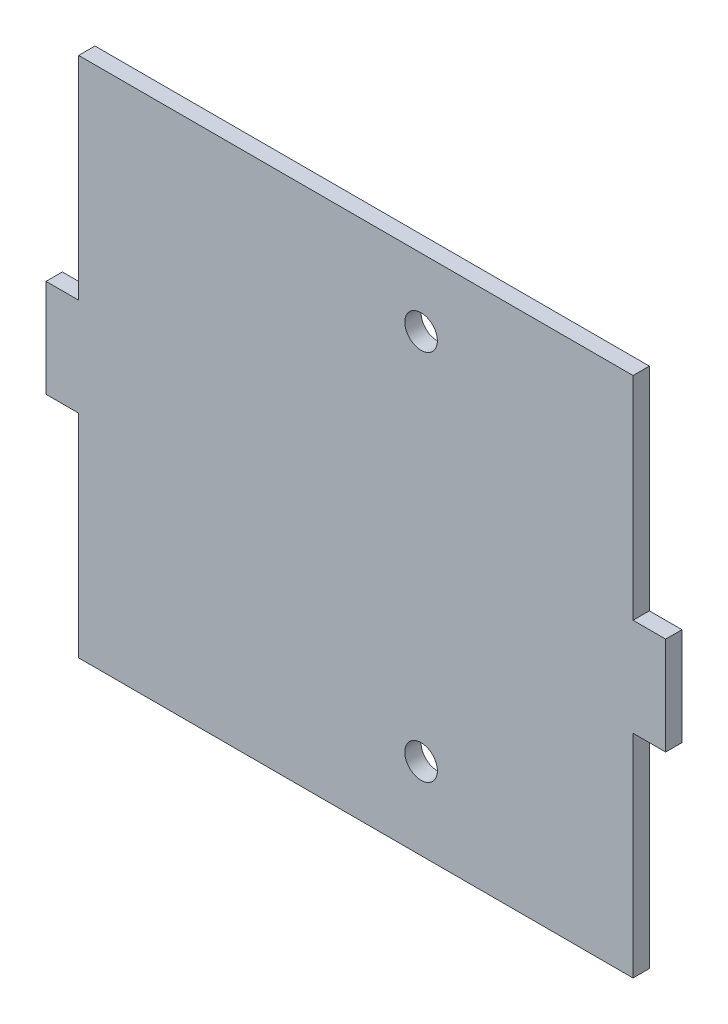
ISO-10303-21;
HEADER;
FILE_DESCRIPTION(('STEP AP214'),'2;1');
FILE_NAME('part.step','',(''),(''),'','','');
FILE_SCHEMA(('AUTOMOTIVE_DESIGN { 1 0 10303 214 1 1 1 1 }'));
ENDSEC;
DATA;
#1=APPLICATION_CONTEXT('core data for automotive mechanical design processes');
#2=APPLICATION_PROTOCOL_DEFINITION('international standard','automotive_design',2000,#1);
#3=PRODUCT_CONTEXT('',#1,'mechanical');
#4=PRODUCT('Part','Part','',(#3));
#5=PRODUCT_RELATED_PRODUCT_CATEGORY('part','',(#4));
#6=PRODUCT_DEFINITION_FORMATION('','',#4);
#7=PRODUCT_DEFINITION_CONTEXT('part definition',#1,'design');
#8=PRODUCT_DEFINITION('design','',#6,#7);
#9=PRODUCT_DEFINITION_SHAPE('','',#8);
#10=(LENGTH_UNIT() NAMED_UNIT(*) SI_UNIT(.MILLI.,.METRE.));
#11=(NAMED_UNIT(*) PLANE_ANGLE_UNIT() SI_UNIT($,.RADIAN.));
#12=(NAMED_UNIT(*) SI_UNIT($,.STERADIAN.) SOLID_ANGLE_UNIT());
#13=UNCERTAINTY_MEASURE_WITH_UNIT(LENGTH_MEASURE(1.E-05),#10,'distance_accuracy_value','');
#14=(GEOMETRIC_REPRESENTATION_CONTEXT(3) GLOBAL_UNCERTAINTY_ASSIGNED_CONTEXT((#13)) GLOBAL_UNIT_ASSIGNED_CONTEXT((#10,
#11,#12)) REPRESENTATION_CONTEXT('',''));
#15=CARTESIAN_POINT('',(0.,0.,0.));
#16=DIRECTION('',(0.,0.,1.));
#17=DIRECTION('',(1.,0.,0.));
#18=AXIS2_PLACEMENT_3D('',#15,#16,#17);
#19=CARTESIAN_POINT('',(215.9,-38.1,6.35));
#20=DIRECTION('',(-1.,0.,0.));
#21=DIRECTION('',(0.,-1.,0.));
#22=AXIS2_PLACEMENT_3D('',#19,#20,#21);
#23=PLANE('',#22);
#24=DIRECTION('',(0.,1.,0.));
#25=VECTOR('',#24,1.);
#26=CARTESIAN_POINT('',(215.9,-38.1,-6.35));
#27=LINE('',#26,#25);
#28=CARTESIAN_POINT('',(215.9,-203.2,-6.35));
#29=VERTEX_POINT('',#28);
#30=CARTESIAN_POINT('',(215.9,-38.1,-6.35));
#31=VERTEX_POINT('',#30);
#32=EDGE_CURVE('E182',#29,#31,#27,.T.);
#33=ORIENTED_EDGE('',*,*,#32,.T.);
#34=DIRECTION('',(0.,0.,-1.));
#35=VECTOR('',#34,1.);
#36=CARTESIAN_POINT('',(215.9,-38.1,6.35));
#37=LINE('',#36,#35);
#38=CARTESIAN_POINT('',(215.9,-38.1,6.35));
#39=VERTEX_POINT('',#38);
#40=EDGE_CURVE('E162',#39,#31,#37,.T.);
#41=ORIENTED_EDGE('',*,*,#40,.F.);
#42=DIRECTION('',(0.,1.,0.));
#43=VECTOR('',#42,1.);
#44=CARTESIAN_POINT('',(215.9,-38.1,6.35));
#45=LINE('',#44,#43);
#46=CARTESIAN_POINT('',(215.9,-203.2,6.35));
#47=VERTEX_POINT('',#46);
#48=EDGE_CURVE('E216',#47,#39,#45,.T.);
#49=ORIENTED_EDGE('',*,*,#48,.F.);
#50=DIRECTION('',(0.,0.,-1.));
#51=VECTOR('',#50,1.);
#52=CARTESIAN_POINT('',(215.9,-203.2,6.35));
#53=LINE('',#52,#51);
#54=EDGE_CURVE('E165',#47,#29,#53,.T.);
#55=ORIENTED_EDGE('',*,*,#54,.T.);
#56=EDGE_LOOP('',(#33,#41,#49,#55));
#57=FACE_BOUND('',#56,.T.);
#58=ADVANCED_FACE('F46',(#57),#23,.F.);
#59=CARTESIAN_POINT('',(215.9,-38.1,6.35));
#60=DIRECTION('',(0.,1.,0.));
#61=DIRECTION('',(-1.,0.,0.));
#62=AXIS2_PLACEMENT_3D('',#59,#60,#61);
#63=PLANE('',#62);
#64=DIRECTION('',(1.,0.,0.));
#65=VECTOR('',#64,1.);
#66=CARTESIAN_POINT('',(215.9,-38.1,-6.35));
#67=LINE('',#66,#65);
#68=CARTESIAN_POINT('',(241.3,-38.1,-6.35));
#69=VERTEX_POINT('',#68);
#70=EDGE_CURVE('E66',#31,#69,#67,.T.);
#71=ORIENTED_EDGE('',*,*,#70,.T.);
#72=DIRECTION('',(0.,0.,-1.));
#73=VECTOR('',#72,1.);
#74=CARTESIAN_POINT('',(241.3,-38.1,6.35));
#75=LINE('',#74,#73);
#76=CARTESIAN_POINT('',(241.3,-38.1,6.35));
#77=VERTEX_POINT('',#76);
#78=EDGE_CURVE('E159',#77,#69,#75,.T.);
#79=ORIENTED_EDGE('',*,*,#78,.F.);
#80=DIRECTION('',(1.,0.,0.));
#81=VECTOR('',#80,1.);
#82=CARTESIAN_POINT('',(215.9,-38.1,6.35));
#83=LINE('',#82,#81);
#84=EDGE_CURVE('E111',#39,#77,#83,.T.);
#85=ORIENTED_EDGE('',*,*,#84,.F.);
#86=ORIENTED_EDGE('',*,*,#40,.T.);
#87=EDGE_LOOP('',(#71,#79,#85,#86));
#88=FACE_BOUND('',#87,.T.);
#89=ADVANCED_FACE('F158',(#88),#63,.F.);
#90=CARTESIAN_POINT('',(241.3,38.1,6.35));
#91=DIRECTION('',(-1.,0.,0.));
#92=DIRECTION('',(0.,0.,1.));
#93=AXIS2_PLACEMENT_3D('',#90,#91,#92);
#94=PLANE('',#93);
#95=DIRECTION('',(0.,1.,0.));
#96=VECTOR('',#95,1.);
#97=CARTESIAN_POINT('',(241.3,38.1,-6.35));
#98=LINE('',#97,#96);
#99=CARTESIAN_POINT('',(241.3,38.1,-6.35));
#100=VERTEX_POINT('',#99);
#101=EDGE_CURVE('E155',#69,#100,#98,.T.);
#102=ORIENTED_EDGE('',*,*,#101,.T.);
#103=DIRECTION('',(0.,0.,-1.));
#104=VECTOR('',#103,1.);
#105=CARTESIAN_POINT('',(241.3,38.1,6.35));
#106=LINE('',#105,#104);
#107=CARTESIAN_POINT('',(241.3,38.1,6.35));
#108=VERTEX_POINT('',#107);
#109=EDGE_CURVE('E264',#108,#100,#106,.T.);
#110=ORIENTED_EDGE('',*,*,#109,.F.);
#111=DIRECTION('',(0.,1.,0.));
#112=VECTOR('',#111,1.);
#113=CARTESIAN_POINT('',(241.3,38.1,6.35));
#114=LINE('',#113,#112);
#115=EDGE_CURVE('E168',#77,#108,#114,.T.);
#116=ORIENTED_EDGE('',*,*,#115,.F.);
#117=ORIENTED_EDGE('',*,*,#78,.T.);
#118=EDGE_LOOP('',(#102,#110,#116,#117));
#119=FACE_BOUND('',#118,.T.);
#120=ADVANCED_FACE('F167',(#119),#94,.F.);
#121=CARTESIAN_POINT('',(215.9,38.1,6.35));
#122=DIRECTION('',(0.,-1.,0.));
#123=DIRECTION('',(0.,0.,-1.));
#124=AXIS2_PLACEMENT_3D('',#121,#122,#123);
#125=PLANE('',#124);
#126=DIRECTION('',(-1.,0.,0.));
#127=VECTOR('',#126,1.);
#128=CARTESIAN_POINT('',(215.9,38.1,-6.35));
#129=LINE('',#128,#127);
#130=CARTESIAN_POINT('',(215.9,38.1,-6.35));
#131=VERTEX_POINT('',#130);
#132=EDGE_CURVE('E170',#100,#131,#129,.T.);
#133=ORIENTED_EDGE('',*,*,#132,.T.);
#134=DIRECTION('',(0.,0.,-1.));
#135=VECTOR('',#134,1.);
#136=CARTESIAN_POINT('',(215.9,38.1,6.35));
#137=LINE('',#136,#135);
#138=CARTESIAN_POINT('',(215.9,38.1,6.35));
#139=VERTEX_POINT('',#138);
#140=EDGE_CURVE('E261',#139,#131,#137,.T.);
#141=ORIENTED_EDGE('',*,*,#140,.F.);
#142=DIRECTION('',(-1.,0.,0.));
#143=VECTOR('',#142,1.);
#144=CARTESIAN_POINT('',(215.9,38.1,6.35));
#145=LINE('',#144,#143);
#146=EDGE_CURVE('E209',#108,#139,#145,.T.);
#147=ORIENTED_EDGE('',*,*,#146,.F.);
#148=ORIENTED_EDGE('',*,*,#109,.T.);
#149=EDGE_LOOP('',(#133,#141,#147,#148));
#150=FACE_BOUND('',#149,.T.);
#151=ADVANCED_FACE('F333',(#150),#125,.F.);
#152=CARTESIAN_POINT('',(215.9,203.2,6.35));
#153=DIRECTION('',(-1.,0.,0.));
#154=DIRECTION('',(0.,-1.,0.));
#155=AXIS2_PLACEMENT_3D('',#152,#153,#154);
#156=PLANE('',#155);
#157=DIRECTION('',(0.,1.,0.));
#158=VECTOR('',#157,1.);
#159=CARTESIAN_POINT('',(215.9,203.2,-6.35));
#160=LINE('',#159,#158);
#161=CARTESIAN_POINT('',(215.9,203.2,-6.35));
#162=VERTEX_POINT('',#161);
#163=EDGE_CURVE('E262',#131,#162,#160,.T.);
#164=ORIENTED_EDGE('',*,*,#163,.T.);
#165=DIRECTION('',(0.,0.,-1.));
#166=VECTOR('',#165,1.);
#167=CARTESIAN_POINT('',(215.9,203.2,6.35));
#168=LINE('',#167,#166);
#169=CARTESIAN_POINT('',(215.9,203.2,6.35));
#170=VERTEX_POINT('',#169);
#171=EDGE_CURVE('E258',#170,#162,#168,.T.);
#172=ORIENTED_EDGE('',*,*,#171,.F.);
#173=DIRECTION('',(0.,1.,0.));
#174=VECTOR('',#173,1.);
#175=CARTESIAN_POINT('',(215.9,203.2,6.35));
#176=LINE('',#175,#174);
#177=EDGE_CURVE('E206',#139,#170,#176,.T.);
#178=ORIENTED_EDGE('',*,*,#177,.F.);
#179=ORIENTED_EDGE('',*,*,#140,.T.);
#180=EDGE_LOOP('',(#164,#172,#178,#179));
#181=FACE_BOUND('',#180,.T.);
#182=ADVANCED_FACE('F336',(#181),#156,.F.);
#183=CARTESIAN_POINT('',(-215.9,203.2,6.35));
#184=DIRECTION('',(0.,-1.,0.));
#185=DIRECTION('',(0.,0.,-1.));
#186=AXIS2_PLACEMENT_3D('',#183,#184,#185);
#187=PLANE('',#186);
#188=DIRECTION('',(-1.,0.,0.));
#189=VECTOR('',#188,1.);
#190=CARTESIAN_POINT('',(-215.9,203.2,-6.35));
#191=LINE('',#190,#189);
#192=CARTESIAN_POINT('',(-215.9,203.2,-6.35));
#193=VERTEX_POINT('',#192);
#194=EDGE_CURVE('E259',#162,#193,#191,.T.);
#195=ORIENTED_EDGE('',*,*,#194,.T.);
#196=DIRECTION('',(0.,0.,-1.));
#197=VECTOR('',#196,1.);
#198=CARTESIAN_POINT('',(-215.9,203.2,6.35));
#199=LINE('',#198,#197);
#200=CARTESIAN_POINT('',(-215.9,203.2,6.35));
#201=VERTEX_POINT('',#200);
#202=EDGE_CURVE('E254',#201,#193,#199,.T.);
#203=ORIENTED_EDGE('',*,*,#202,.F.);
#204=DIRECTION('',(-1.,0.,0.));
#205=VECTOR('',#204,1.);
#206=CARTESIAN_POINT('',(-215.9,203.2,6.35));
#207=LINE('',#206,#205);
#208=EDGE_CURVE('E203',#170,#201,#207,.T.);
#209=ORIENTED_EDGE('',*,*,#208,.F.);
#210=ORIENTED_EDGE('',*,*,#171,.T.);
#211=EDGE_LOOP('',(#195,#203,#209,#210));
#212=FACE_BOUND('',#211,.T.);
#213=ADVANCED_FACE('F339',(#212),#187,.F.);
#214=CARTESIAN_POINT('',(-215.9,203.2,6.35));
#215=DIRECTION('',(1.,0.,0.));
#216=DIRECTION('',(0.,0.,-1.));
#217=AXIS2_PLACEMENT_3D('',#214,#215,#216);
#218=PLANE('',#217);
#219=DIRECTION('',(0.,-1.,0.));
#220=VECTOR('',#219,1.);
#221=CARTESIAN_POINT('',(-215.9,203.2,-6.35));
#222=LINE('',#221,#220);
#223=CARTESIAN_POINT('',(-215.9,38.1,-6.35));
#224=VERTEX_POINT('',#223);
#225=EDGE_CURVE('E255',#193,#224,#222,.T.);
#226=ORIENTED_EDGE('',*,*,#225,.T.);
#227=DIRECTION('',(0.,0.,-1.));
#228=VECTOR('',#227,1.);
#229=CARTESIAN_POINT('',(-215.9,38.1,6.35));
#230=LINE('',#229,#228);
#231=CARTESIAN_POINT('',(-215.9,38.1,6.35));
#232=VERTEX_POINT('',#231);
#233=EDGE_CURVE('E250',#232,#224,#230,.T.);
#234=ORIENTED_EDGE('',*,*,#233,.F.);
#235=DIRECTION('',(0.,-1.,0.));
#236=VECTOR('',#235,1.);
#237=CARTESIAN_POINT('',(-215.9,203.2,6.35));
#238=LINE('',#237,#236);
#239=EDGE_CURVE('E200',#201,#232,#238,.T.);
#240=ORIENTED_EDGE('',*,*,#239,.F.);
#241=ORIENTED_EDGE('',*,*,#202,.T.);
#242=EDGE_LOOP('',(#226,#234,#240,#241));
#243=FACE_BOUND('',#242,.T.);
#244=ADVANCED_FACE('F342',(#243),#218,.F.);
#245=CARTESIAN_POINT('',(-215.9,38.1,6.35));
#246=DIRECTION('',(0.,-1.,0.));
#247=DIRECTION('',(1.,0.,0.));
#248=AXIS2_PLACEMENT_3D('',#245,#246,#247);
#249=PLANE('',#248);
#250=DIRECTION('',(-1.,0.,0.));
#251=VECTOR('',#250,1.);
#252=CARTESIAN_POINT('',(-215.9,38.1,-6.35));
#253=LINE('',#252,#251);
#254=CARTESIAN_POINT('',(-241.3,38.1,-6.35));
#255=VERTEX_POINT('',#254);
#256=EDGE_CURVE('E251',#224,#255,#253,.T.);
#257=ORIENTED_EDGE('',*,*,#256,.T.);
#258=DIRECTION('',(0.,0.,-1.));
#259=VECTOR('',#258,1.);
#260=CARTESIAN_POINT('',(-241.3,38.1,6.35));
#261=LINE('',#260,#259);
#262=CARTESIAN_POINT('',(-241.3,38.1,6.35));
#263=VERTEX_POINT('',#262);
#264=EDGE_CURVE('E246',#263,#255,#261,.T.);
#265=ORIENTED_EDGE('',*,*,#264,.F.);
#266=DIRECTION('',(-1.,0.,0.));
#267=VECTOR('',#266,1.);
#268=CARTESIAN_POINT('',(-215.9,38.1,6.35));
#269=LINE('',#268,#267);
#270=EDGE_CURVE('E197',#232,#263,#269,.T.);
#271=ORIENTED_EDGE('',*,*,#270,.F.);
#272=ORIENTED_EDGE('',*,*,#233,.T.);
#273=EDGE_LOOP('',(#257,#265,#271,#272));
#274=FACE_BOUND('',#273,.T.);
#275=ADVANCED_FACE('F346',(#274),#249,.F.);
#276=CARTESIAN_POINT('',(-241.3,38.1,6.35));
#277=DIRECTION('',(1.,0.,0.));
#278=DIRECTION('',(0.,0.,-1.));
#279=AXIS2_PLACEMENT_3D('',#276,#277,#278);
#280=PLANE('',#279);
#281=DIRECTION('',(0.,-1.,0.));
#282=VECTOR('',#281,1.);
#283=CARTESIAN_POINT('',(-241.3,38.1,-6.35));
#284=LINE('',#283,#282);
#285=CARTESIAN_POINT('',(-241.3,-38.1,-6.35));
#286=VERTEX_POINT('',#285);
#287=EDGE_CURVE('E247',#255,#286,#284,.T.);
#288=ORIENTED_EDGE('',*,*,#287,.T.);
#289=DIRECTION('',(0.,0.,-1.));
#290=VECTOR('',#289,1.);
#291=CARTESIAN_POINT('',(-241.3,-38.1,6.35));
#292=LINE('',#291,#290);
#293=CARTESIAN_POINT('',(-241.3,-38.1,6.35));
#294=VERTEX_POINT('',#293);
#295=EDGE_CURVE('E242',#294,#286,#292,.T.);
#296=ORIENTED_EDGE('',*,*,#295,.F.);
#297=DIRECTION('',(0.,-1.,0.));
#298=VECTOR('',#297,1.);
#299=CARTESIAN_POINT('',(-241.3,38.1,6.35));
#300=LINE('',#299,#298);
#301=EDGE_CURVE('E194',#263,#294,#300,.T.);
#302=ORIENTED_EDGE('',*,*,#301,.F.);
#303=ORIENTED_EDGE('',*,*,#264,.T.);
#304=EDGE_LOOP('',(#288,#296,#302,#303));
#305=FACE_BOUND('',#304,.T.);
#306=ADVANCED_FACE('F350',(#305),#280,.F.);
#307=CARTESIAN_POINT('',(-215.9,-38.1,6.35));
#308=DIRECTION('',(0.,1.,0.));
#309=DIRECTION('',(-1.,0.,0.));
#310=AXIS2_PLACEMENT_3D('',#307,#308,#309);
#311=PLANE('',#310);
#312=DIRECTION('',(1.,0.,0.));
#313=VECTOR('',#312,1.);
#314=CARTESIAN_POINT('',(-215.9,-38.1,-6.35));
#315=LINE('',#314,#313);
#316=CARTESIAN_POINT('',(-215.9,-38.1,-6.35));
#317=VERTEX_POINT('',#316);
#318=EDGE_CURVE('E243',#286,#317,#315,.T.);
#319=ORIENTED_EDGE('',*,*,#318,.T.);
#320=DIRECTION('',(0.,0.,-1.));
#321=VECTOR('',#320,1.);
#322=CARTESIAN_POINT('',(-215.9,-38.1,6.35));
#323=LINE('',#322,#321);
#324=CARTESIAN_POINT('',(-215.9,-38.1,6.35));
#325=VERTEX_POINT('',#324);
#326=EDGE_CURVE('E232',#325,#317,#323,.T.);
#327=ORIENTED_EDGE('',*,*,#326,.F.);
#328=DIRECTION('',(1.,0.,0.));
#329=VECTOR('',#328,1.);
#330=CARTESIAN_POINT('',(-215.9,-38.1,6.35));
#331=LINE('',#330,#329);
#332=EDGE_CURVE('E191',#294,#325,#331,.T.);
#333=ORIENTED_EDGE('',*,*,#332,.F.);
#334=ORIENTED_EDGE('',*,*,#295,.T.);
#335=EDGE_LOOP('',(#319,#327,#333,#334));
#336=FACE_BOUND('',#335,.T.);
#337=ADVANCED_FACE('F292',(#336),#311,.F.);
#338=CARTESIAN_POINT('',(-215.9,-38.1,6.35));
#339=DIRECTION('',(1.,0.,0.));
#340=DIRECTION('',(0.,1.,0.));
#341=AXIS2_PLACEMENT_3D('',#338,#339,#340);
#342=PLANE('',#341);
#343=DIRECTION('',(0.,-1.,0.));
#344=VECTOR('',#343,1.);
#345=CARTESIAN_POINT('',(-215.9,-38.1,-6.35));
#346=LINE('',#345,#344);
#347=CARTESIAN_POINT('',(-215.9,-203.2,-6.35));
#348=VERTEX_POINT('',#347);
#349=EDGE_CURVE('E239',#317,#348,#346,.T.);
#350=ORIENTED_EDGE('',*,*,#349,.T.);
#351=DIRECTION('',(0.,0.,-1.));
#352=VECTOR('',#351,1.);
#353=CARTESIAN_POINT('',(-215.9,-203.2,6.35));
#354=LINE('',#353,#352);
#355=CARTESIAN_POINT('',(-215.9,-203.2,6.35));
#356=VERTEX_POINT('',#355);
#357=EDGE_CURVE('E221',#356,#348,#354,.T.);
#358=ORIENTED_EDGE('',*,*,#357,.F.);
#359=DIRECTION('',(0.,-1.,0.));
#360=VECTOR('',#359,1.);
#361=CARTESIAN_POINT('',(-215.9,-38.1,6.35));
#362=LINE('',#361,#360);
#363=EDGE_CURVE('E188',#325,#356,#362,.T.);
#364=ORIENTED_EDGE('',*,*,#363,.F.);
#365=ORIENTED_EDGE('',*,*,#326,.T.);
#366=EDGE_LOOP('',(#350,#358,#364,#365));
#367=FACE_BOUND('',#366,.T.);
#368=ADVANCED_FACE('F301',(#367),#342,.F.);
#369=CARTESIAN_POINT('',(-215.9,-203.2,6.35));
#370=DIRECTION('',(0.,1.,0.));
#371=DIRECTION('',(0.,0.,1.));
#372=AXIS2_PLACEMENT_3D('',#369,#370,#371);
#373=PLANE('',#372);
#374=DIRECTION('',(1.,0.,0.));
#375=VECTOR('',#374,1.);
#376=CARTESIAN_POINT('',(-215.9,-203.2,-6.35));
#377=LINE('',#376,#375);
#378=EDGE_CURVE('E120',#348,#29,#377,.T.);
#379=ORIENTED_EDGE('',*,*,#378,.T.);
#380=ORIENTED_EDGE('',*,*,#54,.F.);
#381=DIRECTION('',(1.,0.,0.));
#382=VECTOR('',#381,1.);
#383=CARTESIAN_POINT('',(-215.9,-203.2,6.35));
#384=LINE('',#383,#382);
#385=EDGE_CURVE('E185',#356,#47,#384,.T.);
#386=ORIENTED_EDGE('',*,*,#385,.F.);
#387=ORIENTED_EDGE('',*,*,#357,.T.);
#388=EDGE_LOOP('',(#379,#380,#386,#387));
#389=FACE_BOUND('',#388,.T.);
#390=ADVANCED_FACE('F320',(#389),#373,.F.);
#391=CARTESIAN_POINT('',(0.,0.,6.35));
#392=DIRECTION('',(0.,0.,1.));
#393=DIRECTION('',(1.,0.,0.));
#394=AXIS2_PLACEMENT_3D('',#391,#392,#393);
#395=PLANE('',#394);
#396=CARTESIAN_POINT('',(50.8000000000004,150.299999999983,6.34999999999999));
#397=DIRECTION('',(0.,0.,1.));
#398=DIRECTION('',(1.,0.,0.));
#399=AXIS2_PLACEMENT_3D('',#396,#397,#398);
#400=CIRCLE('',#399,12.7000000000001);
#401=CARTESIAN_POINT('',(63.5000000000005,150.299999999983,6.34999999999999));
#402=VERTEX_POINT('',#401);
#403=EDGE_CURVE('E218',#402,#402,#400,.F.);
#404=ORIENTED_EDGE('',*,*,#403,.T.);
#405=EDGE_LOOP('',(#404));
#406=FACE_BOUND('',#405,.T.);
#407=CARTESIAN_POINT('',(50.8000000000004,-139.700000000005,6.34999999999999));
#408=DIRECTION('',(0.,0.,1.));
#409=DIRECTION('',(1.,0.,0.));
#410=AXIS2_PLACEMENT_3D('',#407,#408,#409);
#411=CIRCLE('',#410,12.7000000000001);
#412=CARTESIAN_POINT('',(63.5000000000005,-139.700000000005,6.34999999999999));
#413=VERTEX_POINT('',#412);
#414=EDGE_CURVE('E50',#413,#413,#411,.F.);
#415=ORIENTED_EDGE('',*,*,#414,.T.);
#416=EDGE_LOOP('',(#415));
#417=FACE_BOUND('',#416,.T.);
#418=ORIENTED_EDGE('',*,*,#48,.T.);
#419=ORIENTED_EDGE('',*,*,#84,.T.);
#420=ORIENTED_EDGE('',*,*,#115,.T.);
#421=ORIENTED_EDGE('',*,*,#146,.T.);
#422=ORIENTED_EDGE('',*,*,#177,.T.);
#423=ORIENTED_EDGE('',*,*,#208,.T.);
#424=ORIENTED_EDGE('',*,*,#239,.T.);
#425=ORIENTED_EDGE('',*,*,#270,.T.);
#426=ORIENTED_EDGE('',*,*,#301,.T.);
#427=ORIENTED_EDGE('',*,*,#332,.T.);
#428=ORIENTED_EDGE('',*,*,#363,.T.);
#429=ORIENTED_EDGE('',*,*,#385,.T.);
#430=EDGE_LOOP('',(#418,#419,#420,#421,#422,#423,#424,#425,#426,#427,#428,#429));
#431=FACE_BOUND('',#430,.T.);
#432=ADVANCED_FACE('F48',(#406,#417,#431),#395,.T.);
#433=CARTESIAN_POINT('',(0.,0.,-6.35));
#434=DIRECTION('',(0.,0.,1.));
#435=DIRECTION('',(1.,0.,0.));
#436=AXIS2_PLACEMENT_3D('',#433,#434,#435);
#437=PLANE('',#436);
#438=CARTESIAN_POINT('',(50.8000000000004,150.299999999983,-6.35000000000002));
#439=DIRECTION('',(0.,0.,1.));
#440=DIRECTION('',(1.,0.,0.));
#441=AXIS2_PLACEMENT_3D('',#438,#439,#440);
#442=CIRCLE('',#441,12.7000000000001);
#443=CARTESIAN_POINT('',(63.5000000000005,150.299999999983,-6.35000000000002));
#444=VERTEX_POINT('',#443);
#445=EDGE_CURVE('E11',#444,#444,#442,.F.);
#446=ORIENTED_EDGE('',*,*,#445,.F.);
#447=EDGE_LOOP('',(#446));
#448=FACE_BOUND('',#447,.T.);
#449=CARTESIAN_POINT('',(50.8000000000004,-139.700000000005,-6.34999999999999));
#450=DIRECTION('',(0.,0.,1.));
#451=DIRECTION('',(1.,0.,0.));
#452=AXIS2_PLACEMENT_3D('',#449,#450,#451);
#453=CIRCLE('',#452,12.7000000000001);
#454=CARTESIAN_POINT('',(63.5000000000005,-139.700000000005,-6.34999999999999));
#455=VERTEX_POINT('',#454);
#456=EDGE_CURVE('E57',#455,#455,#453,.F.);
#457=ORIENTED_EDGE('',*,*,#456,.F.);
#458=EDGE_LOOP('',(#457));
#459=FACE_BOUND('',#458,.T.);
#460=ORIENTED_EDGE('',*,*,#32,.F.);
#461=ORIENTED_EDGE('',*,*,#378,.F.);
#462=ORIENTED_EDGE('',*,*,#349,.F.);
#463=ORIENTED_EDGE('',*,*,#318,.F.);
#464=ORIENTED_EDGE('',*,*,#287,.F.);
#465=ORIENTED_EDGE('',*,*,#256,.F.);
#466=ORIENTED_EDGE('',*,*,#225,.F.);
#467=ORIENTED_EDGE('',*,*,#194,.F.);
#468=ORIENTED_EDGE('',*,*,#163,.F.);
#469=ORIENTED_EDGE('',*,*,#132,.F.);
#470=ORIENTED_EDGE('',*,*,#101,.F.);
#471=ORIENTED_EDGE('',*,*,#70,.F.);
#472=EDGE_LOOP('',(#460,#461,#462,#463,#464,#465,#466,#467,#468,#469,#470,#471));
#473=FACE_BOUND('',#472,.T.);
#474=ADVANCED_FACE('F173',(#448,#459,#473),#437,.F.);
#475=CARTESIAN_POINT('',(50.8000000000004,-139.700000000005,173.4));
#476=DIRECTION('',(0.,0.,-1.));
#477=DIRECTION('',(-1.,0.,0.));
#478=AXIS2_PLACEMENT_3D('',#475,#476,#477);
#479=CYLINDRICAL_SURFACE('',#478,12.7000000000001);
#480=ORIENTED_EDGE('',*,*,#414,.F.);
#481=EDGE_LOOP('',(#480));
#482=FACE_BOUND('',#481,.T.);
#483=ORIENTED_EDGE('',*,*,#456,.T.);
#484=EDGE_LOOP('',(#483));
#485=FACE_BOUND('',#484,.T.);
#486=ADVANCED_FACE('F309',(#482,#485),#479,.F.);
#487=CARTESIAN_POINT('',(50.8000000000004,150.299999999983,248.4));
#488=DIRECTION('',(0.,0.,-1.));
#489=DIRECTION('',(-1.,0.,0.));
#490=AXIS2_PLACEMENT_3D('',#487,#488,#489);
#491=CYLINDRICAL_SURFACE('',#490,12.7000000000001);
#492=ORIENTED_EDGE('',*,*,#403,.F.);
#493=EDGE_LOOP('',(#492));
#494=FACE_BOUND('',#493,.T.);
#495=ORIENTED_EDGE('',*,*,#445,.T.);
#496=EDGE_LOOP('',(#495));
#497=FACE_BOUND('',#496,.T.);
#498=ADVANCED_FACE('F317',(#494,#497),#491,.F.);
#499=CLOSED_SHELL('',(#58,#89,#120,#151,#182,#213,#244,#275,#306,#337,#368,#390,#432,#474,#486,#498));
#500=MANIFOLD_SOLID_BREP('B2',#499);
#501=ADVANCED_BREP_SHAPE_REPRESENTATION('',(#18,#500),#14);
#502=SHAPE_DEFINITION_REPRESENTATION(#9,#501);
ENDSEC;
END-ISO-10303-21;
